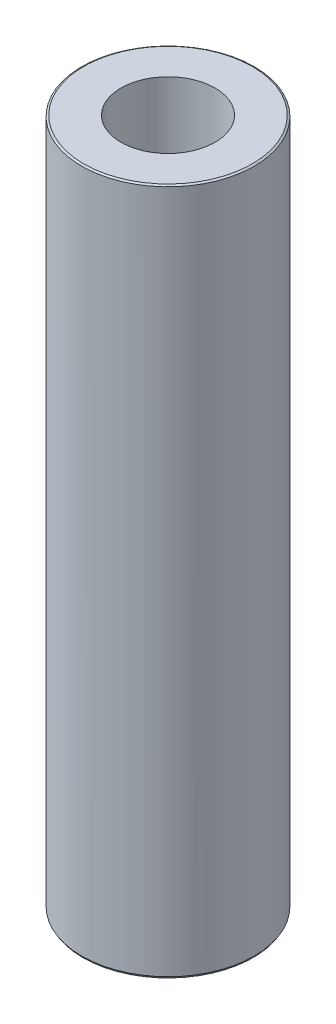
ISO-10303-21;
HEADER;
FILE_DESCRIPTION(('STEP AP214'),'2;1');
FILE_NAME('part.step','',(''),(''),'','','');
FILE_SCHEMA(('AUTOMOTIVE_DESIGN { 1 0 10303 214 1 1 1 1 }'));
ENDSEC;
DATA;
#1=APPLICATION_CONTEXT('core data for automotive mechanical design processes');
#2=APPLICATION_PROTOCOL_DEFINITION('international standard','automotive_design',2000,#1);
#3=PRODUCT_CONTEXT('',#1,'mechanical');
#4=PRODUCT('Part','Part','',(#3));
#5=PRODUCT_RELATED_PRODUCT_CATEGORY('part','',(#4));
#6=PRODUCT_DEFINITION_FORMATION('','',#4);
#7=PRODUCT_DEFINITION_CONTEXT('part definition',#1,'design');
#8=PRODUCT_DEFINITION('design','',#6,#7);
#9=PRODUCT_DEFINITION_SHAPE('','',#8);
#10=(LENGTH_UNIT() NAMED_UNIT(*) SI_UNIT(.MILLI.,.METRE.));
#11=(NAMED_UNIT(*) PLANE_ANGLE_UNIT() SI_UNIT($,.RADIAN.));
#12=(NAMED_UNIT(*) SI_UNIT($,.STERADIAN.) SOLID_ANGLE_UNIT());
#13=UNCERTAINTY_MEASURE_WITH_UNIT(LENGTH_MEASURE(1.E-05),#10,'distance_accuracy_value','');
#14=(GEOMETRIC_REPRESENTATION_CONTEXT(3) GLOBAL_UNCERTAINTY_ASSIGNED_CONTEXT((#13)) GLOBAL_UNIT_ASSIGNED_CONTEXT((#10,
#11,#12)) REPRESENTATION_CONTEXT('',''));
#15=CARTESIAN_POINT('',(0.,0.,0.));
#16=DIRECTION('',(0.,0.,1.));
#17=DIRECTION('',(1.,0.,0.));
#18=AXIS2_PLACEMENT_3D('',#15,#16,#17);
#19=CARTESIAN_POINT('',(0.,358.492041839526,0.));
#20=DIRECTION('',(0.,-1.,0.));
#21=DIRECTION('',(0.,0.,-1.));
#22=AXIS2_PLACEMENT_3D('',#19,#20,#21);
#23=CYLINDRICAL_SURFACE('',#22,45.);
#24=CARTESIAN_POINT('',(0.,357.920691640833,0.));
#25=DIRECTION('',(0.,1.,0.));
#26=DIRECTION('',(0.,0.,1.));
#27=AXIS2_PLACEMENT_3D('',#24,#25,#26);
#28=CIRCLE('',#27,45.);
#29=CARTESIAN_POINT('',(0.,357.920691640833,-45.));
#30=VERTEX_POINT('',#29);
#31=EDGE_CURVE('E50',#30,#30,#28,.F.);
#32=CARTESIAN_POINT('',(0.,0.989607573050999,0.));
#33=DIRECTION('',(0.,1.,0.));
#34=DIRECTION('',(0.,0.,1.));
#35=AXIS2_PLACEMENT_3D('',#32,#33,#34);
#36=CIRCLE('',#35,45.);
#37=CARTESIAN_POINT('',(0.,0.989607573050999,-45.));
#38=VERTEX_POINT('',#37);
#39=EDGE_CURVE('E51',#38,#38,#36,.T.);
#40=CARTESIAN_POINT('',(0.,357.920691640833,-45.));
#41=CARTESIAN_POINT('',(0.,354.202659515127,-45.));
#42=CARTESIAN_POINT('',(0.,350.484627389421,-45.));
#43=CARTESIAN_POINT('',(0.,343.048563138009,-45.));
#44=CARTESIAN_POINT('',(0.,339.330531012303,-45.));
#45=CARTESIAN_POINT('',(0.,331.894466760891,-45.));
#46=CARTESIAN_POINT('',(0.,328.176434635184,-45.));
#47=CARTESIAN_POINT('',(0.,320.740370383772,-45.));
#48=CARTESIAN_POINT('',(0.,317.022338258066,-45.));
#49=CARTESIAN_POINT('',(0.,309.586274006654,-45.));
#50=CARTESIAN_POINT('',(0.,305.868241880948,-45.));
#51=CARTESIAN_POINT('',(0.,298.432177629536,-45.));
#52=CARTESIAN_POINT('',(0.,294.71414550383,-45.));
#53=CARTESIAN_POINT('',(0.,287.278081252418,-45.));
#54=CARTESIAN_POINT('',(0.,283.560049126712,-45.));
#55=CARTESIAN_POINT('',(0.,276.1239848753,-45.));
#56=CARTESIAN_POINT('',(0.,272.405952749593,-45.));
#57=CARTESIAN_POINT('',(0.,264.969888498181,-45.));
#58=CARTESIAN_POINT('',(0.,261.251856372475,-45.));
#59=CARTESIAN_POINT('',(0.,253.815792121063,-45.));
#60=CARTESIAN_POINT('',(0.,250.097759995357,-45.));
#61=CARTESIAN_POINT('',(0.,242.661695743945,-45.));
#62=CARTESIAN_POINT('',(0.,238.943663618239,-45.));
#63=CARTESIAN_POINT('',(0.,231.507599366827,-45.));
#64=CARTESIAN_POINT('',(0.,227.789567241121,-45.));
#65=CARTESIAN_POINT('',(0.,220.353502989709,-45.));
#66=CARTESIAN_POINT('',(0.,216.635470864003,-45.));
#67=CARTESIAN_POINT('',(0.,209.19940661259,-45.));
#68=CARTESIAN_POINT('',(0.,205.481374486884,-45.));
#69=CARTESIAN_POINT('',(0.,198.045310235472,-45.));
#70=CARTESIAN_POINT('',(0.,194.327278109766,-45.));
#71=CARTESIAN_POINT('',(0.,186.891213858354,-45.));
#72=CARTESIAN_POINT('',(0.,183.173181732648,-45.));
#73=CARTESIAN_POINT('',(0.,175.737117481236,-45.));
#74=CARTESIAN_POINT('',(0.,172.01908535553,-45.));
#75=CARTESIAN_POINT('',(0.,164.583021104118,-45.));
#76=CARTESIAN_POINT('',(0.,160.864988978412,-45.));
#77=CARTESIAN_POINT('',(0.,153.428924727,-45.));
#78=CARTESIAN_POINT('',(0.,149.710892601293,-45.));
#79=CARTESIAN_POINT('',(0.,142.274828349881,-45.));
#80=CARTESIAN_POINT('',(0.,138.556796224175,-45.));
#81=CARTESIAN_POINT('',(0.,131.120731972763,-45.));
#82=CARTESIAN_POINT('',(0.,127.402699847057,-45.));
#83=CARTESIAN_POINT('',(0.,119.966635595645,-45.));
#84=CARTESIAN_POINT('',(0.,116.248603469939,-45.));
#85=CARTESIAN_POINT('',(0.,108.812539218527,-45.));
#86=CARTESIAN_POINT('',(0.,105.094507092821,-45.));
#87=CARTESIAN_POINT('',(0.,97.6584428414086,-45.));
#88=CARTESIAN_POINT('',(0.,93.9404107157025,-45.));
#89=CARTESIAN_POINT('',(0.,86.5043464642904,-45.));
#90=CARTESIAN_POINT('',(0.,82.7863143385844,-45.));
#91=CARTESIAN_POINT('',(0.,75.3502500871723,-45.));
#92=CARTESIAN_POINT('',(0.,71.6322179614662,-45.));
#93=CARTESIAN_POINT('',(0.,64.1961537100541,-45.));
#94=CARTESIAN_POINT('',(0.,60.478121584348,-45.));
#95=CARTESIAN_POINT('',(0.,53.0420573329359,-45.));
#96=CARTESIAN_POINT('',(0.,49.3240252072298,-45.));
#97=CARTESIAN_POINT('',(0.,41.8879609558177,-45.));
#98=CARTESIAN_POINT('',(0.,38.1699288301116,-45.));
#99=CARTESIAN_POINT('',(0.,30.7338645786995,-45.));
#100=CARTESIAN_POINT('',(0.,27.0158324529934,-45.));
#101=CARTESIAN_POINT('',(0.,19.5797682015813,-45.));
#102=CARTESIAN_POINT('',(0.,15.8617360758752,-45.));
#103=CARTESIAN_POINT('',(0.,8.42567182446311,-45.));
#104=CARTESIAN_POINT('',(0.,4.70763969875706,-45.));
#105=CARTESIAN_POINT('',(0.,0.989607573050999,-45.));
#106=B_SPLINE_CURVE_WITH_KNOTS('',3,(#40,#41,#42,#43,#44,#45,#46,#47,#48,#49,#50,#51,#52,#53,
#54,#55,#56,#57,#58,#59,#60,#61,#62,#63,#64,#65,#66,#67,#68,#69,#70,#71,#72,#73,#74,#75,#76,#77,
#78,#79,#80,#81,#82,#83,#84,#85,#86,#87,#88,#89,#90,#91,#92,#93,#94,#95,#96,#97,#98,#99,#100,
#101,#102,#103,#104,#105),.UNSPECIFIED.,.F.,.F.,(4,2,2,2,2,2,2,2,2,2,2,2,2,2,2,2,2,2,2,2,2,2,2,
2,2,2,2,2,2,2,2,2,4),(0.,11.1540963771182,22.3081927542363,33.4622891313545,44.6163855084727,
55.7704818855909,66.9245782627091,78.0786746398273,89.2327710169454,100.386867394064,
111.540963771182,122.6950601483,133.849156525418,145.003252902536,156.157349279655,
167.311445656773,178.465542033891,189.619638411009,200.773734788127,211.927831165245,
223.081927542364,234.236023919482,245.3901202966,256.544216673718,267.698313050836,
278.852409427955,290.006505805073,301.160602182191,312.314698559309,323.468794936427,
334.622891313546,345.776987690664,356.931084067782),.UNSPECIFIED.);
#107=EDGE_CURVE('BSEAM39',#30,#38,#106,.T.);
#108=ORIENTED_EDGE('',*,*,#31,.T.);
#109=ORIENTED_EDGE('',*,*,#39,.T.);
#110=ORIENTED_EDGE('',*,*,#107,.T.);
#111=ORIENTED_EDGE('',*,*,#107,.F.);
#112=EDGE_LOOP('',(#108,#110,#109,#111));
#113=FACE_BOUND('',#112,.T.);
#114=ADVANCED_FACE('F39',(#113),#23,.T.);
#115=CARTESIAN_POINT('',(0.,358.492041839526,0.));
#116=DIRECTION('',(0.,1.,0.));
#117=DIRECTION('',(0.,0.,1.));
#118=AXIS2_PLACEMENT_3D('',#115,#116,#117);
#119=PLANE('',#118);
#120=CARTESIAN_POINT('',(0.,358.492041839526,0.));
#121=DIRECTION('',(0.,1.,0.));
#122=DIRECTION('',(0.,0.,1.));
#123=AXIS2_PLACEMENT_3D('',#120,#121,#122);
#124=CIRCLE('',#123,44.0103924269496);
#125=CARTESIAN_POINT('',(0.,358.492041839526,44.0103924269496));
#126=VERTEX_POINT('',#125);
#127=EDGE_CURVE('E54',#126,#126,#124,.T.);
#128=ORIENTED_EDGE('',*,*,#127,.T.);
#129=EDGE_LOOP('',(#128));
#130=FACE_BOUND('',#129,.T.);
#131=CARTESIAN_POINT('',(0.,358.492041839526,0.));
#132=DIRECTION('',(0.,1.,0.));
#133=DIRECTION('',(0.,0.,1.));
#134=AXIS2_PLACEMENT_3D('',#131,#132,#133);
#135=CIRCLE('',#134,24.5483424478912);
#136=CARTESIAN_POINT('',(0.,358.492041839526,-24.5483424478912));
#137=VERTEX_POINT('',#136);
#138=EDGE_CURVE('E58',#137,#137,#135,.T.);
#139=ORIENTED_EDGE('',*,*,#138,.F.);
#140=EDGE_LOOP('',(#139));
#141=FACE_BOUND('',#140,.T.);
#142=ADVANCED_FACE('F69',(#130,#141),#119,.T.);
#143=CARTESIAN_POINT('',(0.,0.,0.));
#144=DIRECTION('',(0.,1.,0.));
#145=DIRECTION('',(0.,0.,1.));
#146=AXIS2_PLACEMENT_3D('',#143,#144,#145);
#147=PLANE('',#146);
#148=CARTESIAN_POINT('',(0.,0.,0.));
#149=DIRECTION('',(0.,1.,0.));
#150=DIRECTION('',(0.,0.,1.));
#151=AXIS2_PLACEMENT_3D('',#148,#149,#150);
#152=CIRCLE('',#151,44.4286498013069);
#153=CARTESIAN_POINT('',(0.,0.,44.4286498013069));
#154=VERTEX_POINT('',#153);
#155=EDGE_CURVE('E10',#154,#154,#152,.F.);
#156=ORIENTED_EDGE('',*,*,#155,.T.);
#157=EDGE_LOOP('',(#156));
#158=FACE_BOUND('',#157,.T.);
#159=CARTESIAN_POINT('',(0.,0.,0.));
#160=DIRECTION('',(0.,1.,0.));
#161=DIRECTION('',(0.,0.,1.));
#162=AXIS2_PLACEMENT_3D('',#159,#160,#161);
#163=CIRCLE('',#162,24.5483424478912);
#164=CARTESIAN_POINT('',(0.,0.,-24.5483424478912));
#165=VERTEX_POINT('',#164);
#166=EDGE_CURVE('E63',#165,#165,#163,.T.);
#167=ORIENTED_EDGE('',*,*,#166,.T.);
#168=EDGE_LOOP('',(#167));
#169=FACE_BOUND('',#168,.T.);
#170=ADVANCED_FACE('F75',(#158,#169),#147,.F.);
#171=CARTESIAN_POINT('',(0.,358.492041839526,0.));
#172=DIRECTION('',(0.,-1.,0.));
#173=DIRECTION('',(0.,0.,-1.));
#174=AXIS2_PLACEMENT_3D('',#171,#172,#173);
#175=CYLINDRICAL_SURFACE('',#174,24.5483424478912);
#176=CARTESIAN_POINT('',(0.,358.492041839526,-24.5483424478912));
#177=CARTESIAN_POINT('',(0.,354.757749737031,-24.5483424478912));
#178=CARTESIAN_POINT('',(0.,351.023457634536,-24.5483424478912));
#179=CARTESIAN_POINT('',(0.,343.554873429545,-24.5483424478912));
#180=CARTESIAN_POINT('',(0.,339.82058132705,-24.5483424478912));
#181=CARTESIAN_POINT('',(0.,332.35199712206,-24.5483424478912));
#182=CARTESIAN_POINT('',(0.,328.617705019565,-24.5483424478912));
#183=CARTESIAN_POINT('',(0.,321.149120814575,-24.5483424478912));
#184=CARTESIAN_POINT('',(0.,317.41482871208,-24.5483424478912));
#185=CARTESIAN_POINT('',(0.,309.94624450709,-24.5483424478912));
#186=CARTESIAN_POINT('',(0.,306.211952404595,-24.5483424478912));
#187=CARTESIAN_POINT('',(0.,298.743368199605,-24.5483424478912));
#188=CARTESIAN_POINT('',(0.,295.00907609711,-24.5483424478912));
#189=CARTESIAN_POINT('',(0.,287.54049189212,-24.5483424478912));
#190=CARTESIAN_POINT('',(0.,283.806199789624,-24.5483424478912));
#191=CARTESIAN_POINT('',(0.,276.337615584634,-24.5483424478912));
#192=CARTESIAN_POINT('',(0.,272.603323482139,-24.5483424478912));
#193=CARTESIAN_POINT('',(0.,265.134739277149,-24.5483424478912));
#194=CARTESIAN_POINT('',(0.,261.400447174654,-24.5483424478912));
#195=CARTESIAN_POINT('',(0.,253.931862969664,-24.5483424478912));
#196=CARTESIAN_POINT('',(0.,250.197570867169,-24.5483424478912));
#197=CARTESIAN_POINT('',(0.,242.728986662179,-24.5483424478912));
#198=CARTESIAN_POINT('',(0.,238.994694559684,-24.5483424478912));
#199=CARTESIAN_POINT('',(0.,231.526110354694,-24.5483424478912));
#200=CARTESIAN_POINT('',(0.,227.791818252199,-24.5483424478912));
#201=CARTESIAN_POINT('',(0.,220.323234047208,-24.5483424478912));
#202=CARTESIAN_POINT('',(0.,216.588941944713,-24.5483424478912));
#203=CARTESIAN_POINT('',(0.,209.120357739723,-24.5483424478912));
#204=CARTESIAN_POINT('',(0.,205.386065637228,-24.5483424478912));
#205=CARTESIAN_POINT('',(0.,197.917481432238,-24.5483424478912));
#206=CARTESIAN_POINT('',(0.,194.183189329743,-24.5483424478912));
#207=CARTESIAN_POINT('',(0.,186.714605124753,-24.5483424478912));
#208=CARTESIAN_POINT('',(0.,182.980313022258,-24.5483424478912));
#209=CARTESIAN_POINT('',(0.,175.511728817268,-24.5483424478912));
#210=CARTESIAN_POINT('',(0.,171.777436714773,-24.5483424478912));
#211=CARTESIAN_POINT('',(0.,164.308852509783,-24.5483424478912));
#212=CARTESIAN_POINT('',(0.,160.574560407288,-24.5483424478912));
#213=CARTESIAN_POINT('',(0.,153.105976202297,-24.5483424478912));
#214=CARTESIAN_POINT('',(0.,149.371684099802,-24.5483424478912));
#215=CARTESIAN_POINT('',(0.,141.903099894812,-24.5483424478912));
#216=CARTESIAN_POINT('',(0.,138.168807792317,-24.5483424478912));
#217=CARTESIAN_POINT('',(0.,130.700223587327,-24.5483424478912));
#218=CARTESIAN_POINT('',(0.,126.965931484832,-24.5483424478912));
#219=CARTESIAN_POINT('',(0.,119.497347279842,-24.5483424478912));
#220=CARTESIAN_POINT('',(0.,115.763055177347,-24.5483424478912));
#221=CARTESIAN_POINT('',(0.,108.294470972357,-24.5483424478912));
#222=CARTESIAN_POINT('',(0.,104.560178869862,-24.5483424478912));
#223=CARTESIAN_POINT('',(0.,97.0915946648716,-24.5483424478912));
#224=CARTESIAN_POINT('',(0.,93.3573025623765,-24.5483424478912));
#225=CARTESIAN_POINT('',(0.,85.8887183573864,-24.5483424478912));
#226=CARTESIAN_POINT('',(0.,82.1544262548913,-24.5483424478912));
#227=CARTESIAN_POINT('',(0.,74.6858420499012,-24.5483424478912));
#228=CARTESIAN_POINT('',(0.,70.9515499474061,-24.5483424478912));
#229=CARTESIAN_POINT('',(0.,63.482965742416,-24.5483424478912));
#230=CARTESIAN_POINT('',(0.,59.7486736399209,-24.5483424478912));
#231=CARTESIAN_POINT('',(0.,52.2800894349308,-24.5483424478912));
#232=CARTESIAN_POINT('',(0.,48.5457973324358,-24.5483424478912));
#233=CARTESIAN_POINT('',(0.,41.0772131274456,-24.5483424478912));
#234=CARTESIAN_POINT('',(0.,37.3429210249506,-24.5483424478912));
#235=CARTESIAN_POINT('',(0.,29.8743368199605,-24.5483424478912));
#236=CARTESIAN_POINT('',(0.,26.1400447174654,-24.5483424478912));
#237=CARTESIAN_POINT('',(0.,18.6714605124753,-24.5483424478912));
#238=CARTESIAN_POINT('',(0.,14.9371684099802,-24.5483424478912));
#239=CARTESIAN_POINT('',(0.,7.46858420499012,-24.5483424478912));
#240=CARTESIAN_POINT('',(0.,3.73429210249506,-24.5483424478912));
#241=CARTESIAN_POINT('',(0.,0.,-24.5483424478912));
#242=B_SPLINE_CURVE_WITH_KNOTS('',3,(#176,#177,#178,#179,#180,#181,#182,#183,#184,#185,#186,
#187,#188,#189,#190,#191,#192,#193,#194,#195,#196,#197,#198,#199,#200,#201,#202,#203,#204,#205,
#206,#207,#208,#209,#210,#211,#212,#213,#214,#215,#216,#217,#218,#219,#220,#221,#222,#223,#224,
#225,#226,#227,#228,#229,#230,#231,#232,#233,#234,#235,#236,#237,#238,#239,#240,#241),
.UNSPECIFIED.,.F.,.F.,(4,2,2,2,2,2,2,2,2,2,2,2,2,2,2,2,2,2,2,2,2,2,2,2,2,2,2,2,2,2,2,2,4),(0.,
11.2028763074852,22.4057526149704,33.6086289224556,44.8115052299408,56.0143815374259,
67.2172578449111,78.4201341523963,89.6230104598815,100.825886767367,112.028763074852,
123.231639382337,134.434515689822,145.637391997307,156.840268304793,168.043144612278,
179.246020919763,190.448897227248,201.651773534733,212.854649842218,224.057526149704,
235.260402457189,246.463278764674,257.666155072159,268.869031379644,280.071907687129,
291.274783994615,302.4776603021,313.680536609585,324.88341291707,336.086289224555,
347.289165532041,358.492041839526),.UNSPECIFIED.);
#243=EDGE_CURVE('BSEAM70',#137,#165,#242,.T.);
#244=ORIENTED_EDGE('',*,*,#138,.T.);
#245=ORIENTED_EDGE('',*,*,#166,.F.);
#246=ORIENTED_EDGE('',*,*,#243,.T.);
#247=ORIENTED_EDGE('',*,*,#243,.F.);
#248=EDGE_LOOP('',(#244,#246,#245,#247));
#249=FACE_BOUND('',#248,.T.);
#250=ADVANCED_FACE('F70',(#249),#175,.F.);
#251=CARTESIAN_POINT('',(0.,358.492041839526,0.));
#252=DIRECTION('',(0.,-1.,0.));
#253=DIRECTION('',(0.,0.,-1.));
#254=AXIS2_PLACEMENT_3D('',#251,#252,#253);
#255=CONICAL_SURFACE('',#254,44.0103924269496,1.04719755119659);
#256=ORIENTED_EDGE('',*,*,#31,.F.);
#257=EDGE_LOOP('',(#256));
#258=FACE_BOUND('',#257,.T.);
#259=ORIENTED_EDGE('',*,*,#127,.F.);
#260=EDGE_LOOP('',(#259));
#261=FACE_BOUND('',#260,.T.);
#262=ADVANCED_FACE('F81',(#258,#261),#255,.T.);
#263=CARTESIAN_POINT('',(0.,0.989607573050999,0.));
#264=DIRECTION('',(0.,1.,0.));
#265=DIRECTION('',(0.,0.,1.));
#266=AXIS2_PLACEMENT_3D('',#263,#264,#265);
#267=CONICAL_SURFACE('',#266,45.,0.523598775598279);
#268=ORIENTED_EDGE('',*,*,#155,.F.);
#269=EDGE_LOOP('',(#268));
#270=FACE_BOUND('',#269,.T.);
#271=ORIENTED_EDGE('',*,*,#39,.F.);
#272=EDGE_LOOP('',(#271));
#273=FACE_BOUND('',#272,.T.);
#274=ADVANCED_FACE('F45',(#270,#273),#267,.T.);
#275=CLOSED_SHELL('',(#114,#142,#170,#250,#262,#274));
#276=MANIFOLD_SOLID_BREP('B2',#275);
#277=ADVANCED_BREP_SHAPE_REPRESENTATION('',(#18,#276),#14);
#278=SHAPE_DEFINITION_REPRESENTATION(#9,#277);
ENDSEC;
END-ISO-10303-21;
